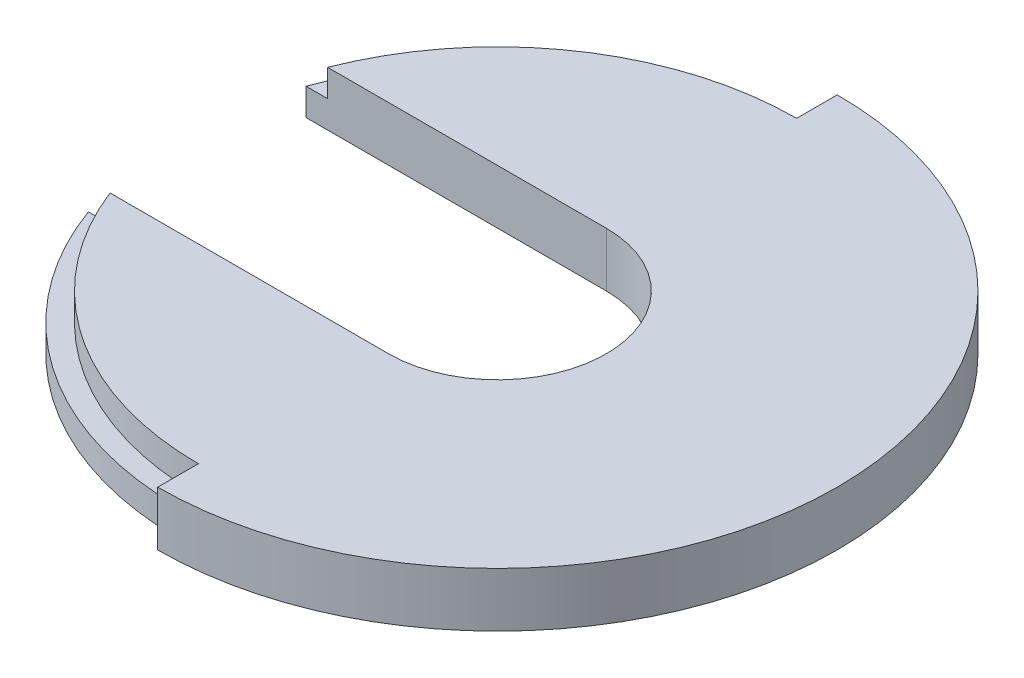
ISO-10303-21;
HEADER;
FILE_DESCRIPTION(('STEP AP214'),'2;1');
FILE_NAME('part.step','',(''),(''),'','','');
FILE_SCHEMA(('AUTOMOTIVE_DESIGN { 1 0 10303 214 1 1 1 1 }'));
ENDSEC;
DATA;
#1=APPLICATION_CONTEXT('core data for automotive mechanical design processes');
#2=APPLICATION_PROTOCOL_DEFINITION('international standard','automotive_design',2000,#1);
#3=PRODUCT_CONTEXT('',#1,'mechanical');
#4=PRODUCT('Part','Part','',(#3));
#5=PRODUCT_RELATED_PRODUCT_CATEGORY('part','',(#4));
#6=PRODUCT_DEFINITION_FORMATION('','',#4);
#7=PRODUCT_DEFINITION_CONTEXT('part definition',#1,'design');
#8=PRODUCT_DEFINITION('design','',#6,#7);
#9=PRODUCT_DEFINITION_SHAPE('','',#8);
#10=(LENGTH_UNIT() NAMED_UNIT(*) SI_UNIT(.MILLI.,.METRE.));
#11=(NAMED_UNIT(*) PLANE_ANGLE_UNIT() SI_UNIT($,.RADIAN.));
#12=(NAMED_UNIT(*) SI_UNIT($,.STERADIAN.) SOLID_ANGLE_UNIT());
#13=UNCERTAINTY_MEASURE_WITH_UNIT(LENGTH_MEASURE(1.E-05),#10,'distance_accuracy_value','');
#14=(GEOMETRIC_REPRESENTATION_CONTEXT(3) GLOBAL_UNCERTAINTY_ASSIGNED_CONTEXT((#13)) GLOBAL_UNIT_ASSIGNED_CONTEXT((#10,
#11,#12)) REPRESENTATION_CONTEXT('',''));
#15=CARTESIAN_POINT('',(0.,0.,0.));
#16=DIRECTION('',(0.,0.,1.));
#17=DIRECTION('',(1.,0.,0.));
#18=AXIS2_PLACEMENT_3D('',#15,#16,#17);
#19=CARTESIAN_POINT('',(0.,2.,0.));
#20=DIRECTION('',(1.,0.,0.));
#21=DIRECTION('',(0.,0.,-1.));
#22=AXIS2_PLACEMENT_3D('',#19,#20,#21);
#23=PLANE('',#22);
#24=DIRECTION('',(0.,-1.,0.));
#25=VECTOR('',#24,1.);
#26=CARTESIAN_POINT('',(0.,2.,-11.0045));
#27=LINE('',#26,#25);
#28=CARTESIAN_POINT('',(0.,2.,-11.0045));
#29=VERTEX_POINT('',#28);
#30=CARTESIAN_POINT('',(0.,1.,-11.0045));
#31=VERTEX_POINT('',#30);
#32=EDGE_CURVE('E71',#29,#31,#27,.T.);
#33=ORIENTED_EDGE('',*,*,#32,.F.);
#34=DIRECTION('',(0.,0.,1.));
#35=VECTOR('',#34,1.);
#36=CARTESIAN_POINT('',(0.,2.,0.));
#37=LINE('',#36,#35);
#38=CARTESIAN_POINT('',(0.,2.,-12.5));
#39=VERTEX_POINT('',#38);
#40=EDGE_CURVE('E150',#39,#29,#37,.T.);
#41=ORIENTED_EDGE('',*,*,#40,.F.);
#42=DIRECTION('',(0.,-1.,0.));
#43=VECTOR('',#42,1.);
#44=CARTESIAN_POINT('',(0.,2.,-12.5));
#45=LINE('',#44,#43);
#46=CARTESIAN_POINT('',(0.,0.,-12.5));
#47=VERTEX_POINT('',#46);
#48=EDGE_CURVE('E246',#39,#47,#45,.T.);
#49=ORIENTED_EDGE('',*,*,#48,.T.);
#50=DIRECTION('',(0.,0.,1.));
#51=VECTOR('',#50,1.);
#52=CARTESIAN_POINT('',(0.,0.,0.));
#53=LINE('',#52,#51);
#54=CARTESIAN_POINT('',(0.,0.,-11.75));
#55=VERTEX_POINT('',#54);
#56=EDGE_CURVE('E238',#47,#55,#53,.T.);
#57=ORIENTED_EDGE('',*,*,#56,.T.);
#58=DIRECTION('',(0.,-1.,0.));
#59=VECTOR('',#58,1.);
#60=CARTESIAN_POINT('',(0.,2.,-11.75));
#61=LINE('',#60,#59);
#62=CARTESIAN_POINT('',(0.,1.,-11.75));
#63=VERTEX_POINT('',#62);
#64=EDGE_CURVE('E235',#63,#55,#61,.T.);
#65=ORIENTED_EDGE('',*,*,#64,.F.);
#66=DIRECTION('',(0.,0.,-1.));
#67=VECTOR('',#66,1.);
#68=CARTESIAN_POINT('',(0.,1.,0.));
#69=LINE('',#68,#67);
#70=EDGE_CURVE('E192',#31,#63,#69,.T.);
#71=ORIENTED_EDGE('',*,*,#70,.F.);
#72=EDGE_LOOP('',(#33,#41,#49,#57,#65,#71));
#73=FACE_BOUND('',#72,.T.);
#74=ADVANCED_FACE('F56',(#73),#23,.F.);
#75=CARTESIAN_POINT('',(0.,1.,0.));
#76=DIRECTION('',(0.,1.,0.));
#77=DIRECTION('',(0.,0.,1.));
#78=AXIS2_PLACEMENT_3D('',#75,#76,#77);
#79=PLANE('',#78);
#80=DIRECTION('',(1.,0.,0.));
#81=VECTOR('',#80,1.);
#82=CARTESIAN_POINT('',(0.,1.,-4.0025));
#83=LINE('',#82,#81);
#84=CARTESIAN_POINT('',(-11.0472844513935,1.,-4.0025));
#85=VERTEX_POINT('',#84);
#86=CARTESIAN_POINT('',(-10.2508055293231,1.,-4.0025));
#87=VERTEX_POINT('',#86);
#88=EDGE_CURVE('E188',#85,#87,#83,.T.);
#89=ORIENTED_EDGE('',*,*,#88,.T.);
#90=CARTESIAN_POINT('',(0.,1.,0.));
#91=DIRECTION('',(0.,1.,0.));
#92=DIRECTION('',(0.,0.,1.));
#93=AXIS2_PLACEMENT_3D('',#90,#91,#92);
#94=CIRCLE('',#93,11.0045);
#95=EDGE_CURVE('E12',#87,#31,#94,.F.);
#96=ORIENTED_EDGE('',*,*,#95,.T.);
#97=ORIENTED_EDGE('',*,*,#70,.T.);
#98=CARTESIAN_POINT('',(0.,1.,0.));
#99=DIRECTION('',(0.,1.,0.));
#100=DIRECTION('',(0.,0.,1.));
#101=AXIS2_PLACEMENT_3D('',#98,#99,#100);
#102=CIRCLE('',#101,11.75);
#103=EDGE_CURVE('E185',#63,#85,#102,.T.);
#104=ORIENTED_EDGE('',*,*,#103,.T.);
#105=EDGE_LOOP('',(#89,#96,#97,#104));
#106=FACE_BOUND('',#105,.T.);
#107=ADVANCED_FACE('F298',(#106),#79,.T.);
#108=DIRECTION('',(0.,-1.,0.));
#109=VECTOR('',#108,1.);
#110=CARTESIAN_POINT('',(0.,2.,11.0045));
#111=LINE('',#110,#109);
#112=CARTESIAN_POINT('',(0.,2.,11.0045));
#113=VERTEX_POINT('',#112);
#114=CARTESIAN_POINT('',(0.,1.,11.0045));
#115=VERTEX_POINT('',#114);
#116=EDGE_CURVE('E177',#113,#115,#111,.T.);
#117=ORIENTED_EDGE('',*,*,#116,.T.);
#118=DIRECTION('',(0.,0.,-1.));
#119=VECTOR('',#118,1.);
#120=CARTESIAN_POINT('',(0.,1.,0.));
#121=LINE('',#120,#119);
#122=CARTESIAN_POINT('',(0.,1.,11.75));
#123=VERTEX_POINT('',#122);
#124=EDGE_CURVE('E199',#123,#115,#121,.T.);
#125=ORIENTED_EDGE('',*,*,#124,.F.);
#126=DIRECTION('',(0.,-1.,0.));
#127=VECTOR('',#126,1.);
#128=CARTESIAN_POINT('',(0.,2.,11.75));
#129=LINE('',#128,#127);
#130=CARTESIAN_POINT('',(0.,0.,11.75));
#131=VERTEX_POINT('',#130);
#132=EDGE_CURVE('E231',#131,#123,#129,.F.);
#133=ORIENTED_EDGE('',*,*,#132,.F.);
#134=CARTESIAN_POINT('',(0.,0.,12.5));
#135=VERTEX_POINT('',#134);
#136=EDGE_CURVE('E250',#131,#135,#53,.T.);
#137=ORIENTED_EDGE('',*,*,#136,.T.);
#138=DIRECTION('',(0.,-1.,0.));
#139=VECTOR('',#138,1.);
#140=CARTESIAN_POINT('',(0.,2.,12.5));
#141=LINE('',#140,#139);
#142=CARTESIAN_POINT('',(0.,2.,12.5));
#143=VERTEX_POINT('',#142);
#144=EDGE_CURVE('E256',#143,#135,#141,.T.);
#145=ORIENTED_EDGE('',*,*,#144,.F.);
#146=EDGE_CURVE('E241',#113,#143,#37,.T.);
#147=ORIENTED_EDGE('',*,*,#146,.F.);
#148=EDGE_LOOP('',(#117,#125,#133,#137,#145,#147));
#149=FACE_BOUND('',#148,.T.);
#150=ADVANCED_FACE('F294',(#149),#23,.F.);
#151=CARTESIAN_POINT('',(0.,1.,0.));
#152=DIRECTION('',(0.,1.,0.));
#153=DIRECTION('',(0.,0.,1.));
#154=AXIS2_PLACEMENT_3D('',#151,#152,#153);
#155=PLANE('',#154);
#156=ORIENTED_EDGE('',*,*,#124,.T.);
#157=CARTESIAN_POINT('',(0.,1.,0.));
#158=DIRECTION('',(0.,1.,0.));
#159=DIRECTION('',(0.,0.,1.));
#160=AXIS2_PLACEMENT_3D('',#157,#158,#159);
#161=CIRCLE('',#160,11.0045);
#162=CARTESIAN_POINT('',(-10.2508055293231,1.,4.0025));
#163=VERTEX_POINT('',#162);
#164=EDGE_CURVE('E64',#115,#163,#161,.F.);
#165=ORIENTED_EDGE('',*,*,#164,.T.);
#166=DIRECTION('',(1.,0.,0.));
#167=VECTOR('',#166,1.);
#168=CARTESIAN_POINT('',(0.,1.,4.0025));
#169=LINE('',#168,#167);
#170=CARTESIAN_POINT('',(-11.0472844513935,1.,4.0025));
#171=VERTEX_POINT('',#170);
#172=EDGE_CURVE('E184',#171,#163,#169,.T.);
#173=ORIENTED_EDGE('',*,*,#172,.F.);
#174=CARTESIAN_POINT('',(0.,1.,0.));
#175=DIRECTION('',(0.,1.,0.));
#176=DIRECTION('',(0.,0.,1.));
#177=AXIS2_PLACEMENT_3D('',#174,#175,#176);
#178=CIRCLE('',#177,11.75);
#179=EDGE_CURVE('E189',#171,#123,#178,.T.);
#180=ORIENTED_EDGE('',*,*,#179,.T.);
#181=EDGE_LOOP('',(#156,#165,#173,#180));
#182=FACE_BOUND('',#181,.T.);
#183=ADVANCED_FACE('F270',(#182),#155,.T.);
#184=CARTESIAN_POINT('',(0.,2.,0.));
#185=DIRECTION('',(0.,-1.,0.));
#186=DIRECTION('',(0.,0.,-1.));
#187=AXIS2_PLACEMENT_3D('',#184,#185,#186);
#188=CYLINDRICAL_SURFACE('',#187,11.75);
#189=ORIENTED_EDGE('',*,*,#103,.F.);
#190=ORIENTED_EDGE('',*,*,#64,.T.);
#191=CARTESIAN_POINT('',(0.,0.,0.));
#192=DIRECTION('',(0.,1.,0.));
#193=DIRECTION('',(0.,0.,1.));
#194=AXIS2_PLACEMENT_3D('',#191,#192,#193);
#195=CIRCLE('',#194,11.75);
#196=CARTESIAN_POINT('',(-11.0472844513935,0.,-4.0025));
#197=VERTEX_POINT('',#196);
#198=EDGE_CURVE('E195',#55,#197,#195,.T.);
#199=ORIENTED_EDGE('',*,*,#198,.T.);
#200=DIRECTION('',(0.,-1.,0.));
#201=VECTOR('',#200,1.);
#202=CARTESIAN_POINT('',(-11.0472844513935,2.,-4.0025));
#203=LINE('',#202,#201);
#204=EDGE_CURVE('E264',#85,#197,#203,.T.);
#205=ORIENTED_EDGE('',*,*,#204,.F.);
#206=EDGE_LOOP('',(#189,#190,#199,#205));
#207=FACE_BOUND('',#206,.T.);
#208=ADVANCED_FACE('F308',(#207),#188,.T.);
#209=ORIENTED_EDGE('',*,*,#179,.F.);
#210=DIRECTION('',(0.,-1.,0.));
#211=VECTOR('',#210,1.);
#212=CARTESIAN_POINT('',(-11.0472844513935,2.,4.0025));
#213=LINE('',#212,#211);
#214=CARTESIAN_POINT('',(-11.0472844513935,0.,4.0025));
#215=VERTEX_POINT('',#214);
#216=EDGE_CURVE('E260',#171,#215,#213,.T.);
#217=ORIENTED_EDGE('',*,*,#216,.T.);
#218=CARTESIAN_POINT('',(0.,0.,0.));
#219=DIRECTION('',(0.,1.,0.));
#220=DIRECTION('',(0.,0.,1.));
#221=AXIS2_PLACEMENT_3D('',#218,#219,#220);
#222=CIRCLE('',#221,11.75);
#223=EDGE_CURVE('E215',#215,#131,#222,.T.);
#224=ORIENTED_EDGE('',*,*,#223,.T.);
#225=ORIENTED_EDGE('',*,*,#132,.T.);
#226=EDGE_LOOP('',(#209,#217,#224,#225));
#227=FACE_BOUND('',#226,.T.);
#228=ADVANCED_FACE('F281',(#227),#188,.T.);
#229=CARTESIAN_POINT('',(0.,11.,-4.0025));
#230=DIRECTION('',(0.,0.,1.));
#231=DIRECTION('',(1.,0.,0.));
#232=AXIS2_PLACEMENT_3D('',#229,#230,#231);
#233=PLANE('',#232);
#234=DIRECTION('',(0.,-1.,0.));
#235=VECTOR('',#234,1.);
#236=CARTESIAN_POINT('',(-10.2508055293231,2.,-4.0025));
#237=LINE('',#236,#235);
#238=CARTESIAN_POINT('',(-10.2508055293231,2.,-4.0025));
#239=VERTEX_POINT('',#238);
#240=EDGE_CURVE('E155',#239,#87,#237,.T.);
#241=ORIENTED_EDGE('',*,*,#240,.T.);
#242=ORIENTED_EDGE('',*,*,#88,.F.);
#243=ORIENTED_EDGE('',*,*,#204,.T.);
#244=DIRECTION('',(-1.,0.,0.));
#245=VECTOR('',#244,1.);
#246=CARTESIAN_POINT('',(0.,0.,-4.0025));
#247=LINE('',#246,#245);
#248=CARTESIAN_POINT('',(0.,0.,-4.0025));
#249=VERTEX_POINT('',#248);
#250=EDGE_CURVE('E209',#249,#197,#247,.T.);
#251=ORIENTED_EDGE('',*,*,#250,.F.);
#252=DIRECTION('',(0.,-1.,0.));
#253=VECTOR('',#252,1.);
#254=CARTESIAN_POINT('',(0.,11.,-4.0025));
#255=LINE('',#254,#253);
#256=CARTESIAN_POINT('',(0.,2.,-4.0025));
#257=VERTEX_POINT('',#256);
#258=EDGE_CURVE('E164',#257,#249,#255,.T.);
#259=ORIENTED_EDGE('',*,*,#258,.F.);
#260=DIRECTION('',(-1.,0.,0.));
#261=VECTOR('',#260,1.);
#262=CARTESIAN_POINT('',(0.,2.,-4.0025));
#263=LINE('',#262,#261);
#264=EDGE_CURVE('E149',#257,#239,#263,.T.);
#265=ORIENTED_EDGE('',*,*,#264,.T.);
#266=EDGE_LOOP('',(#241,#242,#243,#251,#259,#265));
#267=FACE_BOUND('',#266,.T.);
#268=ADVANCED_FACE('F162',(#267),#233,.T.);
#269=CARTESIAN_POINT('',(0.,11.,4.0025));
#270=DIRECTION('',(0.,0.,1.));
#271=DIRECTION('',(1.,0.,0.));
#272=AXIS2_PLACEMENT_3D('',#269,#270,#271);
#273=PLANE('',#272);
#274=DIRECTION('',(-1.,0.,0.));
#275=VECTOR('',#274,1.);
#276=CARTESIAN_POINT('',(0.,0.,4.0025));
#277=LINE('',#276,#275);
#278=CARTESIAN_POINT('',(0.,0.,4.0025));
#279=VERTEX_POINT('',#278);
#280=EDGE_CURVE('E212',#279,#215,#277,.T.);
#281=ORIENTED_EDGE('',*,*,#280,.T.);
#282=ORIENTED_EDGE('',*,*,#216,.F.);
#283=ORIENTED_EDGE('',*,*,#172,.T.);
#284=DIRECTION('',(0.,-1.,0.));
#285=VECTOR('',#284,1.);
#286=CARTESIAN_POINT('',(-10.2508055293231,2.,4.0025));
#287=LINE('',#286,#285);
#288=CARTESIAN_POINT('',(-10.2508055293231,2.,4.0025));
#289=VERTEX_POINT('',#288);
#290=EDGE_CURVE('E181',#289,#163,#287,.T.);
#291=ORIENTED_EDGE('',*,*,#290,.F.);
#292=DIRECTION('',(-1.,0.,0.));
#293=VECTOR('',#292,1.);
#294=CARTESIAN_POINT('',(0.,2.,4.0025));
#295=LINE('',#294,#293);
#296=CARTESIAN_POINT('',(0.,2.,4.0025));
#297=VERTEX_POINT('',#296);
#298=EDGE_CURVE('E170',#297,#289,#295,.T.);
#299=ORIENTED_EDGE('',*,*,#298,.F.);
#300=DIRECTION('',(0.,-1.,0.));
#301=VECTOR('',#300,1.);
#302=CARTESIAN_POINT('',(0.,11.,4.0025));
#303=LINE('',#302,#301);
#304=EDGE_CURVE('E223',#297,#279,#303,.T.);
#305=ORIENTED_EDGE('',*,*,#304,.T.);
#306=EDGE_LOOP('',(#281,#282,#283,#291,#299,#305));
#307=FACE_BOUND('',#306,.T.);
#308=ADVANCED_FACE('F277',(#307),#273,.F.);
#309=CARTESIAN_POINT('',(0.,2.,0.));
#310=DIRECTION('',(0.,1.,0.));
#311=DIRECTION('',(0.,0.,1.));
#312=AXIS2_PLACEMENT_3D('',#309,#310,#311);
#313=PLANE('',#312);
#314=ORIENTED_EDGE('',*,*,#40,.T.);
#315=CARTESIAN_POINT('',(0.,2.,0.));
#316=DIRECTION('',(0.,1.,0.));
#317=DIRECTION('',(0.,0.,1.));
#318=AXIS2_PLACEMENT_3D('',#315,#316,#317);
#319=CIRCLE('',#318,11.0045);
#320=EDGE_CURVE('E144',#29,#239,#319,.T.);
#321=ORIENTED_EDGE('',*,*,#320,.T.);
#322=ORIENTED_EDGE('',*,*,#264,.F.);
#323=CARTESIAN_POINT('',(0.,2.,0.));
#324=DIRECTION('',(0.,1.,0.));
#325=DIRECTION('',(0.,0.,1.));
#326=AXIS2_PLACEMENT_3D('',#323,#324,#325);
#327=CIRCLE('',#326,4.0025);
#328=EDGE_CURVE('E228',#257,#297,#327,.F.);
#329=ORIENTED_EDGE('',*,*,#328,.T.);
#330=ORIENTED_EDGE('',*,*,#298,.T.);
#331=CARTESIAN_POINT('',(0.,2.,0.));
#332=DIRECTION('',(0.,1.,0.));
#333=DIRECTION('',(0.,0.,1.));
#334=AXIS2_PLACEMENT_3D('',#331,#332,#333);
#335=CIRCLE('',#334,11.0045);
#336=EDGE_CURVE('E174',#289,#113,#335,.T.);
#337=ORIENTED_EDGE('',*,*,#336,.T.);
#338=ORIENTED_EDGE('',*,*,#146,.T.);
#339=CARTESIAN_POINT('',(0.,2.,0.));
#340=DIRECTION('',(0.,1.,0.));
#341=DIRECTION('',(0.,0.,1.));
#342=AXIS2_PLACEMENT_3D('',#339,#340,#341);
#343=CIRCLE('',#342,12.5);
#344=EDGE_CURVE('E243',#143,#39,#343,.T.);
#345=ORIENTED_EDGE('',*,*,#344,.T.);
#346=EDGE_LOOP('',(#314,#321,#322,#329,#330,#337,#338,#345));
#347=FACE_BOUND('',#346,.T.);
#348=ADVANCED_FACE('F146',(#347),#313,.T.);
#349=CARTESIAN_POINT('',(0.,2.,0.));
#350=DIRECTION('',(0.,-1.,0.));
#351=DIRECTION('',(0.,0.,-1.));
#352=AXIS2_PLACEMENT_3D('',#349,#350,#351);
#353=CYLINDRICAL_SURFACE('',#352,12.5);
#354=CARTESIAN_POINT('',(0.,0.,0.));
#355=DIRECTION('',(0.,1.,0.));
#356=DIRECTION('',(0.,0.,1.));
#357=AXIS2_PLACEMENT_3D('',#354,#355,#356);
#358=CIRCLE('',#357,12.5);
#359=EDGE_CURVE('E242',#135,#47,#358,.T.);
#360=ORIENTED_EDGE('',*,*,#359,.T.);
#361=ORIENTED_EDGE('',*,*,#48,.F.);
#362=ORIENTED_EDGE('',*,*,#344,.F.);
#363=ORIENTED_EDGE('',*,*,#144,.T.);
#364=EDGE_LOOP('',(#360,#361,#362,#363));
#365=FACE_BOUND('',#364,.T.);
#366=ADVANCED_FACE('F296',(#365),#353,.T.);
#367=CARTESIAN_POINT('',(0.,0.,0.));
#368=DIRECTION('',(0.,1.,0.));
#369=DIRECTION('',(0.,0.,1.));
#370=AXIS2_PLACEMENT_3D('',#367,#368,#369);
#371=PLANE('',#370);
#372=CARTESIAN_POINT('',(0.,0.,0.));
#373=DIRECTION('',(0.,1.,0.));
#374=DIRECTION('',(0.,0.,1.));
#375=AXIS2_PLACEMENT_3D('',#372,#373,#374);
#376=CIRCLE('',#375,4.0025);
#377=EDGE_CURVE('E219',#279,#249,#376,.T.);
#378=ORIENTED_EDGE('',*,*,#377,.T.);
#379=ORIENTED_EDGE('',*,*,#250,.T.);
#380=ORIENTED_EDGE('',*,*,#198,.F.);
#381=ORIENTED_EDGE('',*,*,#56,.F.);
#382=ORIENTED_EDGE('',*,*,#359,.F.);
#383=ORIENTED_EDGE('',*,*,#136,.F.);
#384=ORIENTED_EDGE('',*,*,#223,.F.);
#385=ORIENTED_EDGE('',*,*,#280,.F.);
#386=EDGE_LOOP('',(#378,#379,#380,#381,#382,#383,#384,#385));
#387=FACE_BOUND('',#386,.T.);
#388=ADVANCED_FACE('F284',(#387),#371,.F.);
#389=CARTESIAN_POINT('',(0.,11.,0.));
#390=DIRECTION('',(0.,-1.,0.));
#391=DIRECTION('',(0.,0.,-1.));
#392=AXIS2_PLACEMENT_3D('',#389,#390,#391);
#393=CYLINDRICAL_SURFACE('',#392,4.0025);
#394=ORIENTED_EDGE('',*,*,#258,.T.);
#395=ORIENTED_EDGE('',*,*,#377,.F.);
#396=ORIENTED_EDGE('',*,*,#304,.F.);
#397=ORIENTED_EDGE('',*,*,#328,.F.);
#398=EDGE_LOOP('',(#394,#395,#396,#397));
#399=FACE_BOUND('',#398,.T.);
#400=ADVANCED_FACE('F322',(#399),#393,.F.);
#401=CARTESIAN_POINT('',(0.,2.,0.));
#402=DIRECTION('',(0.,-1.,0.));
#403=DIRECTION('',(0.,0.,-1.));
#404=AXIS2_PLACEMENT_3D('',#401,#402,#403);
#405=CYLINDRICAL_SURFACE('',#404,11.0045);
#406=ORIENTED_EDGE('',*,*,#164,.F.);
#407=ORIENTED_EDGE('',*,*,#116,.F.);
#408=ORIENTED_EDGE('',*,*,#336,.F.);
#409=ORIENTED_EDGE('',*,*,#290,.T.);
#410=EDGE_LOOP('',(#406,#407,#408,#409));
#411=FACE_BOUND('',#410,.T.);
#412=ADVANCED_FACE('F324',(#411),#405,.T.);
#413=CARTESIAN_POINT('',(0.,2.,0.));
#414=DIRECTION('',(0.,-1.,0.));
#415=DIRECTION('',(0.,0.,-1.));
#416=AXIS2_PLACEMENT_3D('',#413,#414,#415);
#417=CYLINDRICAL_SURFACE('',#416,11.0045);
#418=ORIENTED_EDGE('',*,*,#95,.F.);
#419=ORIENTED_EDGE('',*,*,#240,.F.);
#420=ORIENTED_EDGE('',*,*,#320,.F.);
#421=ORIENTED_EDGE('',*,*,#32,.T.);
#422=EDGE_LOOP('',(#418,#419,#420,#421));
#423=FACE_BOUND('',#422,.T.);
#424=ADVANCED_FACE('F156',(#423),#417,.T.);
#425=CLOSED_SHELL('',(#74,#107,#150,#183,#208,#228,#268,#308,#348,#366,#388,#400,#412,#424));
#426=MANIFOLD_SOLID_BREP('B2',#425);
#427=ADVANCED_BREP_SHAPE_REPRESENTATION('',(#18,#426),#14);
#428=SHAPE_DEFINITION_REPRESENTATION(#9,#427);
ENDSEC;
END-ISO-10303-21;
